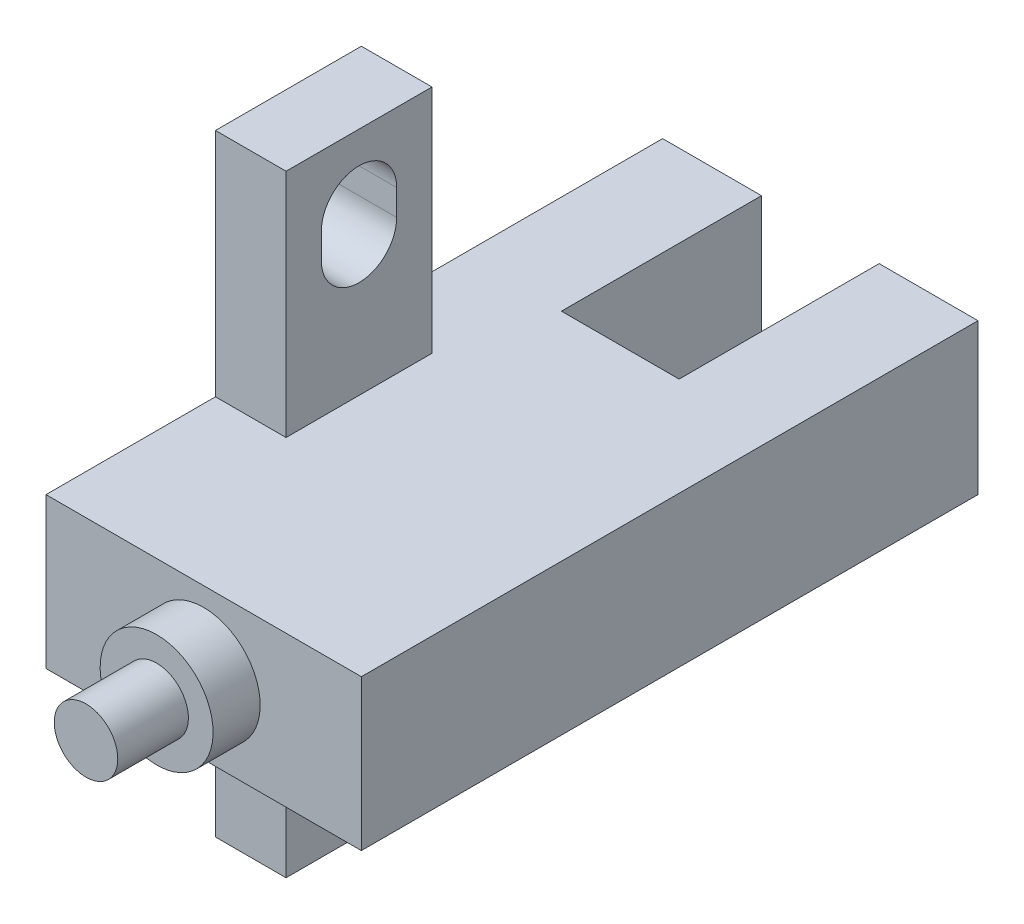
ISO-10303-21;
HEADER;
FILE_DESCRIPTION(('STEP AP214'),'2;1');
FILE_NAME('part.step','',(''),(''),'','','');
FILE_SCHEMA(('AUTOMOTIVE_DESIGN { 1 0 10303 214 1 1 1 1 }'));
ENDSEC;
DATA;
#1=APPLICATION_CONTEXT('core data for automotive mechanical design processes');
#2=APPLICATION_PROTOCOL_DEFINITION('international standard','automotive_design',2000,#1);
#3=PRODUCT_CONTEXT('',#1,'mechanical');
#4=PRODUCT('Part','Part','',(#3));
#5=PRODUCT_RELATED_PRODUCT_CATEGORY('part','',(#4));
#6=PRODUCT_DEFINITION_FORMATION('','',#4);
#7=PRODUCT_DEFINITION_CONTEXT('part definition',#1,'design');
#8=PRODUCT_DEFINITION('design','',#6,#7);
#9=PRODUCT_DEFINITION_SHAPE('','',#8);
#10=(LENGTH_UNIT() NAMED_UNIT(*) SI_UNIT(.MILLI.,.METRE.));
#11=(NAMED_UNIT(*) PLANE_ANGLE_UNIT() SI_UNIT($,.RADIAN.));
#12=(NAMED_UNIT(*) SI_UNIT($,.STERADIAN.) SOLID_ANGLE_UNIT());
#13=UNCERTAINTY_MEASURE_WITH_UNIT(LENGTH_MEASURE(1.E-05),#10,'distance_accuracy_value','');
#14=(GEOMETRIC_REPRESENTATION_CONTEXT(3) GLOBAL_UNCERTAINTY_ASSIGNED_CONTEXT((#13)) GLOBAL_UNIT_ASSIGNED_CONTEXT((#10,
#11,#12)) REPRESENTATION_CONTEXT('',''));
#15=CARTESIAN_POINT('',(0.,0.,0.));
#16=DIRECTION('',(0.,0.,1.));
#17=DIRECTION('',(1.,0.,0.));
#18=AXIS2_PLACEMENT_3D('',#15,#16,#17);
#19=CARTESIAN_POINT('',(-6.7,6.4,-26.2));
#20=DIRECTION('',(0.,0.,1.));
#21=DIRECTION('',(1.,0.,0.));
#22=AXIS2_PLACEMENT_3D('',#19,#20,#21);
#23=PLANE('',#22);
#24=DIRECTION('',(-1.,0.,0.));
#25=VECTOR('',#24,1.);
#26=CARTESIAN_POINT('',(-6.7,6.4,-26.2));
#27=LINE('',#26,#25);
#28=CARTESIAN_POINT('',(-2.5,6.4,-26.2));
#29=VERTEX_POINT('',#28);
#30=CARTESIAN_POINT('',(-6.7,6.4,-26.2));
#31=VERTEX_POINT('',#30);
#32=EDGE_CURVE('E341',#29,#31,#27,.T.);
#33=ORIENTED_EDGE('',*,*,#32,.F.);
#34=DIRECTION('',(0.,1.,0.));
#35=VECTOR('',#34,1.);
#36=CARTESIAN_POINT('',(-2.5,0.,-26.2));
#37=LINE('',#36,#35);
#38=CARTESIAN_POINT('',(-2.5,0.,-26.2));
#39=VERTEX_POINT('',#38);
#40=EDGE_CURVE('E325',#39,#29,#37,.T.);
#41=ORIENTED_EDGE('',*,*,#40,.F.);
#42=DIRECTION('',(-1.,0.,0.));
#43=VECTOR('',#42,1.);
#44=CARTESIAN_POINT('',(-6.7,0.,-26.2));
#45=LINE('',#44,#43);
#46=CARTESIAN_POINT('',(-6.7,0.,-26.2));
#47=VERTEX_POINT('',#46);
#48=EDGE_CURVE('E353',#39,#47,#45,.T.);
#49=ORIENTED_EDGE('',*,*,#48,.T.);
#50=DIRECTION('',(0.,-1.,0.));
#51=VECTOR('',#50,1.);
#52=CARTESIAN_POINT('',(-6.7,6.4,-26.2));
#53=LINE('',#52,#51);
#54=EDGE_CURVE('E345',#31,#47,#53,.T.);
#55=ORIENTED_EDGE('',*,*,#54,.F.);
#56=EDGE_LOOP('',(#33,#41,#49,#55));
#57=FACE_BOUND('',#56,.T.);
#58=ADVANCED_FACE('F32',(#57),#23,.F.);
#59=CARTESIAN_POINT('',(-6.7,6.4,0.));
#60=DIRECTION('',(1.,0.,0.));
#61=DIRECTION('',(0.,0.,-1.));
#62=AXIS2_PLACEMENT_3D('',#59,#60,#61);
#63=PLANE('',#62);
#64=DIRECTION('',(0.,-1.,0.));
#65=VECTOR('',#64,1.);
#66=CARTESIAN_POINT('',(-6.7,-6.85,-8.70000000000001));
#67=LINE('',#66,#65);
#68=CARTESIAN_POINT('',(-6.7,-5.75,-8.70000000000001));
#69=VERTEX_POINT('',#68);
#70=CARTESIAN_POINT('',(-6.7,-6.85,-8.70000000000001));
#71=VERTEX_POINT('',#70);
#72=EDGE_CURVE('E200',#69,#71,#67,.T.);
#73=ORIENTED_EDGE('',*,*,#72,.T.);
#74=CARTESIAN_POINT('',(-6.7,-6.85,-10.3));
#75=DIRECTION('',(1.,0.,0.));
#76=DIRECTION('',(0.,0.,1.));
#77=AXIS2_PLACEMENT_3D('',#74,#75,#76);
#78=CIRCLE('',#77,1.59999999999999);
#79=CARTESIAN_POINT('',(-6.7,-6.85,-11.9));
#80=VERTEX_POINT('',#79);
#81=EDGE_CURVE('E194',#71,#80,#78,.T.);
#82=ORIENTED_EDGE('',*,*,#81,.T.);
#83=DIRECTION('',(0.,1.,0.));
#84=VECTOR('',#83,1.);
#85=CARTESIAN_POINT('',(-6.7,-6.85,-11.9));
#86=LINE('',#85,#84);
#87=CARTESIAN_POINT('',(-6.7,-5.75,-11.9));
#88=VERTEX_POINT('',#87);
#89=EDGE_CURVE('E203',#80,#88,#86,.T.);
#90=ORIENTED_EDGE('',*,*,#89,.T.);
#91=CARTESIAN_POINT('',(-6.7,-5.75,-10.3));
#92=DIRECTION('',(1.,0.,0.));
#93=DIRECTION('',(0.,0.,1.));
#94=AXIS2_PLACEMENT_3D('',#91,#92,#93);
#95=CIRCLE('',#94,1.59999999999999);
#96=EDGE_CURVE('E47',#88,#69,#95,.T.);
#97=ORIENTED_EDGE('',*,*,#96,.T.);
#98=EDGE_LOOP('',(#73,#82,#90,#97));
#99=FACE_BOUND('',#98,.T.);
#100=DIRECTION('',(0.,1.,0.));
#101=VECTOR('',#100,1.);
#102=CARTESIAN_POINT('',(-6.7,13.25,-11.9));
#103=LINE('',#102,#101);
#104=CARTESIAN_POINT('',(-6.7,12.15,-11.9));
#105=VERTEX_POINT('',#104);
#106=CARTESIAN_POINT('',(-6.7,13.25,-11.9));
#107=VERTEX_POINT('',#106);
#108=EDGE_CURVE('E241',#105,#107,#103,.T.);
#109=ORIENTED_EDGE('',*,*,#108,.T.);
#110=CARTESIAN_POINT('',(-6.7,13.25,-10.3));
#111=DIRECTION('',(1.,0.,0.));
#112=DIRECTION('',(0.,0.,-1.));
#113=AXIS2_PLACEMENT_3D('',#110,#111,#112);
#114=CIRCLE('',#113,1.59999999999999);
#115=CARTESIAN_POINT('',(-6.7,13.25,-8.70000000000001));
#116=VERTEX_POINT('',#115);
#117=EDGE_CURVE('E231',#107,#116,#114,.T.);
#118=ORIENTED_EDGE('',*,*,#117,.T.);
#119=DIRECTION('',(0.,-1.,0.));
#120=VECTOR('',#119,1.);
#121=CARTESIAN_POINT('',(-6.7,13.25,-8.70000000000001));
#122=LINE('',#121,#120);
#123=CARTESIAN_POINT('',(-6.7,12.15,-8.70000000000001));
#124=VERTEX_POINT('',#123);
#125=EDGE_CURVE('E234',#116,#124,#122,.T.);
#126=ORIENTED_EDGE('',*,*,#125,.T.);
#127=CARTESIAN_POINT('',(-6.7,12.15,-10.3));
#128=DIRECTION('',(1.,0.,0.));
#129=DIRECTION('',(0.,0.,-1.));
#130=AXIS2_PLACEMENT_3D('',#127,#128,#129);
#131=CIRCLE('',#130,1.59999999999999);
#132=EDGE_CURVE('E238',#124,#105,#131,.T.);
#133=ORIENTED_EDGE('',*,*,#132,.T.);
#134=EDGE_LOOP('',(#109,#118,#126,#133));
#135=FACE_BOUND('',#134,.T.);
#136=DIRECTION('',(0.,0.,1.));
#137=VECTOR('',#136,1.);
#138=CARTESIAN_POINT('',(-6.7,6.4,0.));
#139=LINE('',#138,#137);
#140=CARTESIAN_POINT('',(-6.7,6.4,-7.2));
#141=VERTEX_POINT('',#140);
#142=CARTESIAN_POINT('',(-6.7,6.4,0.));
#143=VERTEX_POINT('',#142);
#144=EDGE_CURVE('E337',#141,#143,#139,.T.);
#145=ORIENTED_EDGE('',*,*,#144,.F.);
#146=DIRECTION('',(0.,1.,0.));
#147=VECTOR('',#146,1.);
#148=CARTESIAN_POINT('',(-6.7,16.2,-7.19999999999999));
#149=LINE('',#148,#147);
#150=CARTESIAN_POINT('',(-6.7,16.2,-7.19999999999999));
#151=VERTEX_POINT('',#150);
#152=EDGE_CURVE('E284',#141,#151,#149,.T.);
#153=ORIENTED_EDGE('',*,*,#152,.T.);
#154=DIRECTION('',(0.,0.,-1.));
#155=VECTOR('',#154,1.);
#156=CARTESIAN_POINT('',(-6.7,16.2,-13.4));
#157=LINE('',#156,#155);
#158=CARTESIAN_POINT('',(-6.7,16.2,-13.4));
#159=VERTEX_POINT('',#158);
#160=EDGE_CURVE('E287',#151,#159,#157,.T.);
#161=ORIENTED_EDGE('',*,*,#160,.T.);
#162=DIRECTION('',(0.,-1.,0.));
#163=VECTOR('',#162,1.);
#164=CARTESIAN_POINT('',(-6.7,16.2,-13.4));
#165=LINE('',#164,#163);
#166=CARTESIAN_POINT('',(-6.7,6.4,-13.4));
#167=VERTEX_POINT('',#166);
#168=EDGE_CURVE('E278',#159,#167,#165,.T.);
#169=ORIENTED_EDGE('',*,*,#168,.T.);
#170=EDGE_CURVE('E334',#31,#167,#139,.T.);
#171=ORIENTED_EDGE('',*,*,#170,.F.);
#172=ORIENTED_EDGE('',*,*,#54,.T.);
#173=DIRECTION('',(0.,0.,1.));
#174=VECTOR('',#173,1.);
#175=CARTESIAN_POINT('',(-6.7,0.,0.));
#176=LINE('',#175,#174);
#177=CARTESIAN_POINT('',(-6.7,0.,-13.4));
#178=VERTEX_POINT('',#177);
#179=EDGE_CURVE('E346',#47,#178,#176,.T.);
#180=ORIENTED_EDGE('',*,*,#179,.T.);
#181=CARTESIAN_POINT('',(-6.7,-9.8,-13.4));
#182=VERTEX_POINT('',#181);
#183=EDGE_CURVE('E256',#178,#182,#165,.T.);
#184=ORIENTED_EDGE('',*,*,#183,.T.);
#185=DIRECTION('',(0.,0.,1.));
#186=VECTOR('',#185,1.);
#187=CARTESIAN_POINT('',(-6.7,-9.8,-13.4));
#188=LINE('',#187,#186);
#189=CARTESIAN_POINT('',(-6.7,-9.8,-7.2));
#190=VERTEX_POINT('',#189);
#191=EDGE_CURVE('E281',#182,#190,#188,.T.);
#192=ORIENTED_EDGE('',*,*,#191,.T.);
#193=CARTESIAN_POINT('',(-6.7,0.,-7.19999999999999));
#194=VERTEX_POINT('',#193);
#195=EDGE_CURVE('E285',#190,#194,#149,.T.);
#196=ORIENTED_EDGE('',*,*,#195,.T.);
#197=CARTESIAN_POINT('',(-6.7,0.,0.));
#198=VERTEX_POINT('',#197);
#199=EDGE_CURVE('E327',#194,#198,#176,.T.);
#200=ORIENTED_EDGE('',*,*,#199,.T.);
#201=DIRECTION('',(0.,-1.,0.));
#202=VECTOR('',#201,1.);
#203=CARTESIAN_POINT('',(-6.7,6.4,0.));
#204=LINE('',#203,#202);
#205=EDGE_CURVE('E365',#143,#198,#204,.T.);
#206=ORIENTED_EDGE('',*,*,#205,.F.);
#207=EDGE_LOOP('',(#145,#153,#161,#169,#171,#172,#180,#184,#192,#196,#200,#206));
#208=FACE_BOUND('',#207,.T.);
#209=ADVANCED_FACE('F34',(#99,#135,#208),#63,.F.);
#210=CARTESIAN_POINT('',(-6.7,6.4,0.));
#211=DIRECTION('',(0.,0.,-1.));
#212=DIRECTION('',(-1.,0.,0.));
#213=AXIS2_PLACEMENT_3D('',#210,#211,#212);
#214=PLANE('',#213);
#215=CARTESIAN_POINT('',(0.,3.2,0.));
#216=DIRECTION('',(0.,0.,-1.));
#217=DIRECTION('',(0.,1.,0.));
#218=AXIS2_PLACEMENT_3D('',#215,#216,#217);
#219=CIRCLE('',#218,2.4);
#220=CARTESIAN_POINT('',(0.,5.6,0.));
#221=VERTEX_POINT('',#220);
#222=EDGE_CURVE('E215',#221,#221,#219,.T.);
#223=ORIENTED_EDGE('',*,*,#222,.T.);
#224=EDGE_LOOP('',(#223));
#225=FACE_BOUND('',#224,.T.);
#226=DIRECTION('',(1.,0.,0.));
#227=VECTOR('',#226,1.);
#228=CARTESIAN_POINT('',(-6.7,0.,0.));
#229=LINE('',#228,#227);
#230=CARTESIAN_POINT('',(6.7,0.,0.));
#231=VERTEX_POINT('',#230);
#232=EDGE_CURVE('E349',#198,#231,#229,.T.);
#233=ORIENTED_EDGE('',*,*,#232,.T.);
#234=DIRECTION('',(0.,-1.,0.));
#235=VECTOR('',#234,1.);
#236=CARTESIAN_POINT('',(6.7,6.4,0.));
#237=LINE('',#236,#235);
#238=CARTESIAN_POINT('',(6.7,6.4,0.));
#239=VERTEX_POINT('',#238);
#240=EDGE_CURVE('E362',#239,#231,#237,.T.);
#241=ORIENTED_EDGE('',*,*,#240,.F.);
#242=DIRECTION('',(1.,0.,0.));
#243=VECTOR('',#242,1.);
#244=CARTESIAN_POINT('',(-6.7,6.4,0.));
#245=LINE('',#244,#243);
#246=EDGE_CURVE('E336',#143,#239,#245,.T.);
#247=ORIENTED_EDGE('',*,*,#246,.F.);
#248=ORIENTED_EDGE('',*,*,#205,.T.);
#249=EDGE_LOOP('',(#233,#241,#247,#248));
#250=FACE_BOUND('',#249,.T.);
#251=ADVANCED_FACE('F422',(#225,#250),#214,.F.);
#252=CARTESIAN_POINT('',(6.7,6.4,0.));
#253=DIRECTION('',(-1.,0.,0.));
#254=DIRECTION('',(0.,0.,1.));
#255=AXIS2_PLACEMENT_3D('',#252,#253,#254);
#256=PLANE('',#255);
#257=DIRECTION('',(0.,0.,-1.));
#258=VECTOR('',#257,1.);
#259=CARTESIAN_POINT('',(6.7,0.,0.));
#260=LINE('',#259,#258);
#261=CARTESIAN_POINT('',(6.7,0.,-26.2));
#262=VERTEX_POINT('',#261);
#263=EDGE_CURVE('E351',#231,#262,#260,.T.);
#264=ORIENTED_EDGE('',*,*,#263,.T.);
#265=DIRECTION('',(0.,-1.,0.));
#266=VECTOR('',#265,1.);
#267=CARTESIAN_POINT('',(6.7,6.4,-26.2));
#268=LINE('',#267,#266);
#269=CARTESIAN_POINT('',(6.7,6.4,-26.2));
#270=VERTEX_POINT('',#269);
#271=EDGE_CURVE('E359',#270,#262,#268,.T.);
#272=ORIENTED_EDGE('',*,*,#271,.F.);
#273=DIRECTION('',(0.,0.,-1.));
#274=VECTOR('',#273,1.);
#275=CARTESIAN_POINT('',(6.7,6.4,0.));
#276=LINE('',#275,#274);
#277=EDGE_CURVE('E339',#239,#270,#276,.T.);
#278=ORIENTED_EDGE('',*,*,#277,.F.);
#279=ORIENTED_EDGE('',*,*,#240,.T.);
#280=EDGE_LOOP('',(#264,#272,#278,#279));
#281=FACE_BOUND('',#280,.T.);
#282=ADVANCED_FACE('F418',(#281),#256,.F.);
#283=CARTESIAN_POINT('',(2.5,0.,-26.2));
#284=VERTEX_POINT('',#283);
#285=EDGE_CURVE('E354',#262,#284,#45,.T.);
#286=ORIENTED_EDGE('',*,*,#285,.T.);
#287=DIRECTION('',(0.,1.,0.));
#288=VECTOR('',#287,1.);
#289=CARTESIAN_POINT('',(2.5,0.,-26.2));
#290=LINE('',#289,#288);
#291=CARTESIAN_POINT('',(2.5,6.4,-26.2));
#292=VERTEX_POINT('',#291);
#293=EDGE_CURVE('E328',#284,#292,#290,.T.);
#294=ORIENTED_EDGE('',*,*,#293,.T.);
#295=EDGE_CURVE('E342',#270,#292,#27,.T.);
#296=ORIENTED_EDGE('',*,*,#295,.F.);
#297=ORIENTED_EDGE('',*,*,#271,.T.);
#298=EDGE_LOOP('',(#286,#294,#296,#297));
#299=FACE_BOUND('',#298,.T.);
#300=ADVANCED_FACE('F413',(#299),#23,.F.);
#301=CARTESIAN_POINT('',(-6.7,6.4,-26.2));
#302=DIRECTION('',(0.,-1.,0.));
#303=DIRECTION('',(0.,0.,-1.));
#304=AXIS2_PLACEMENT_3D('',#301,#302,#303);
#305=PLANE('',#304);
#306=ORIENTED_EDGE('',*,*,#170,.T.);
#307=DIRECTION('',(1.,0.,0.));
#308=VECTOR('',#307,1.);
#309=CARTESIAN_POINT('',(-6.7,6.4,-13.4));
#310=LINE('',#309,#308);
#311=CARTESIAN_POINT('',(-3.7,6.4,-13.4));
#312=VERTEX_POINT('',#311);
#313=EDGE_CURVE('E305',#167,#312,#310,.T.);
#314=ORIENTED_EDGE('',*,*,#313,.T.);
#315=DIRECTION('',(0.,0.,-1.));
#316=VECTOR('',#315,1.);
#317=CARTESIAN_POINT('',(-3.7,6.4,-26.2));
#318=LINE('',#317,#316);
#319=CARTESIAN_POINT('',(-3.7,6.4,-7.19999999999999));
#320=VERTEX_POINT('',#319);
#321=EDGE_CURVE('E292',#320,#312,#318,.T.);
#322=ORIENTED_EDGE('',*,*,#321,.F.);
#323=DIRECTION('',(-1.,0.,0.));
#324=VECTOR('',#323,1.);
#325=CARTESIAN_POINT('',(-6.7,6.4,-7.19999999999999));
#326=LINE('',#325,#324);
#327=EDGE_CURVE('E302',#320,#141,#326,.T.);
#328=ORIENTED_EDGE('',*,*,#327,.T.);
#329=ORIENTED_EDGE('',*,*,#144,.T.);
#330=ORIENTED_EDGE('',*,*,#246,.T.);
#331=ORIENTED_EDGE('',*,*,#277,.T.);
#332=ORIENTED_EDGE('',*,*,#295,.T.);
#333=DIRECTION('',(0.,0.,-1.));
#334=VECTOR('',#333,1.);
#335=CARTESIAN_POINT('',(2.5,6.4,-26.2));
#336=LINE('',#335,#334);
#337=CARTESIAN_POINT('',(2.5,6.4,-17.7));
#338=VERTEX_POINT('',#337);
#339=EDGE_CURVE('E312',#338,#292,#336,.T.);
#340=ORIENTED_EDGE('',*,*,#339,.F.);
#341=DIRECTION('',(1.,0.,0.));
#342=VECTOR('',#341,1.);
#343=CARTESIAN_POINT('',(-2.5,6.4,-17.7));
#344=LINE('',#343,#342);
#345=CARTESIAN_POINT('',(-2.5,6.4,-17.7));
#346=VERTEX_POINT('',#345);
#347=EDGE_CURVE('E321',#346,#338,#344,.T.);
#348=ORIENTED_EDGE('',*,*,#347,.F.);
#349=DIRECTION('',(0.,0.,1.));
#350=VECTOR('',#349,1.);
#351=CARTESIAN_POINT('',(-2.5,6.4,-26.2));
#352=LINE('',#351,#350);
#353=EDGE_CURVE('E307',#29,#346,#352,.T.);
#354=ORIENTED_EDGE('',*,*,#353,.F.);
#355=ORIENTED_EDGE('',*,*,#32,.T.);
#356=EDGE_LOOP('',(#306,#314,#322,#328,#329,#330,#331,#332,#340,#348,#354,#355));
#357=FACE_BOUND('',#356,.T.);
#358=ADVANCED_FACE('F424',(#357),#305,.F.);
#359=CARTESIAN_POINT('',(-6.7,0.,-26.2));
#360=DIRECTION('',(0.,-1.,0.));
#361=DIRECTION('',(0.,0.,-1.));
#362=AXIS2_PLACEMENT_3D('',#359,#360,#361);
#363=PLANE('',#362);
#364=DIRECTION('',(1.,0.,0.));
#365=VECTOR('',#364,1.);
#366=CARTESIAN_POINT('',(-6.7,0.,-13.4));
#367=LINE('',#366,#365);
#368=CARTESIAN_POINT('',(-3.7,0.,-13.4));
#369=VERTEX_POINT('',#368);
#370=EDGE_CURVE('E11',#178,#369,#367,.T.);
#371=ORIENTED_EDGE('',*,*,#370,.F.);
#372=ORIENTED_EDGE('',*,*,#179,.F.);
#373=ORIENTED_EDGE('',*,*,#48,.F.);
#374=DIRECTION('',(0.,0.,1.));
#375=VECTOR('',#374,1.);
#376=CARTESIAN_POINT('',(-2.5,0.,-26.2));
#377=LINE('',#376,#375);
#378=CARTESIAN_POINT('',(-2.5,0.,-17.7));
#379=VERTEX_POINT('',#378);
#380=EDGE_CURVE('E308',#39,#379,#377,.T.);
#381=ORIENTED_EDGE('',*,*,#380,.T.);
#382=DIRECTION('',(1.,0.,0.));
#383=VECTOR('',#382,1.);
#384=CARTESIAN_POINT('',(-2.5,0.,-17.7));
#385=LINE('',#384,#383);
#386=CARTESIAN_POINT('',(2.5,0.,-17.7));
#387=VERTEX_POINT('',#386);
#388=EDGE_CURVE('E311',#379,#387,#385,.T.);
#389=ORIENTED_EDGE('',*,*,#388,.T.);
#390=DIRECTION('',(0.,0.,-1.));
#391=VECTOR('',#390,1.);
#392=CARTESIAN_POINT('',(2.5,0.,-26.2));
#393=LINE('',#392,#391);
#394=EDGE_CURVE('E315',#387,#284,#393,.T.);
#395=ORIENTED_EDGE('',*,*,#394,.T.);
#396=ORIENTED_EDGE('',*,*,#285,.F.);
#397=ORIENTED_EDGE('',*,*,#263,.F.);
#398=ORIENTED_EDGE('',*,*,#232,.F.);
#399=ORIENTED_EDGE('',*,*,#199,.F.);
#400=DIRECTION('',(-1.,0.,0.));
#401=VECTOR('',#400,1.);
#402=CARTESIAN_POINT('',(-6.7,0.,-7.2));
#403=LINE('',#402,#401);
#404=CARTESIAN_POINT('',(-3.7,0.,-7.2));
#405=VERTEX_POINT('',#404);
#406=EDGE_CURVE('E40',#405,#194,#403,.T.);
#407=ORIENTED_EDGE('',*,*,#406,.F.);
#408=DIRECTION('',(0.,0.,-1.));
#409=VECTOR('',#408,1.);
#410=CARTESIAN_POINT('',(-3.7,0.,-26.2));
#411=LINE('',#410,#409);
#412=EDGE_CURVE('E368',#405,#369,#411,.T.);
#413=ORIENTED_EDGE('',*,*,#412,.T.);
#414=EDGE_LOOP('',(#371,#372,#373,#381,#389,#395,#396,#397,#398,#399,#407,#413));
#415=FACE_BOUND('',#414,.T.);
#416=ADVANCED_FACE('F380',(#415),#363,.T.);
#417=CARTESIAN_POINT('',(-2.5,0.,-26.2));
#418=DIRECTION('',(-1.,0.,0.));
#419=DIRECTION('',(0.,0.,1.));
#420=AXIS2_PLACEMENT_3D('',#417,#418,#419);
#421=PLANE('',#420);
#422=ORIENTED_EDGE('',*,*,#353,.T.);
#423=DIRECTION('',(0.,1.,0.));
#424=VECTOR('',#423,1.);
#425=CARTESIAN_POINT('',(-2.5,0.,-17.7));
#426=LINE('',#425,#424);
#427=EDGE_CURVE('E318',#379,#346,#426,.T.);
#428=ORIENTED_EDGE('',*,*,#427,.F.);
#429=ORIENTED_EDGE('',*,*,#380,.F.);
#430=ORIENTED_EDGE('',*,*,#40,.T.);
#431=EDGE_LOOP('',(#422,#428,#429,#430));
#432=FACE_BOUND('',#431,.T.);
#433=ADVANCED_FACE('F402',(#432),#421,.F.);
#434=CARTESIAN_POINT('',(2.5,0.,-26.2));
#435=DIRECTION('',(1.,0.,0.));
#436=DIRECTION('',(0.,0.,-1.));
#437=AXIS2_PLACEMENT_3D('',#434,#435,#436);
#438=PLANE('',#437);
#439=ORIENTED_EDGE('',*,*,#339,.T.);
#440=ORIENTED_EDGE('',*,*,#293,.F.);
#441=ORIENTED_EDGE('',*,*,#394,.F.);
#442=DIRECTION('',(0.,1.,0.));
#443=VECTOR('',#442,1.);
#444=CARTESIAN_POINT('',(2.5,0.,-17.7));
#445=LINE('',#444,#443);
#446=EDGE_CURVE('E331',#387,#338,#445,.T.);
#447=ORIENTED_EDGE('',*,*,#446,.T.);
#448=EDGE_LOOP('',(#439,#440,#441,#447));
#449=FACE_BOUND('',#448,.T.);
#450=ADVANCED_FACE('F410',(#449),#438,.F.);
#451=CARTESIAN_POINT('',(-2.5,0.,-17.7));
#452=DIRECTION('',(0.,0.,1.));
#453=DIRECTION('',(1.,0.,0.));
#454=AXIS2_PLACEMENT_3D('',#451,#452,#453);
#455=PLANE('',#454);
#456=ORIENTED_EDGE('',*,*,#347,.T.);
#457=ORIENTED_EDGE('',*,*,#446,.F.);
#458=ORIENTED_EDGE('',*,*,#388,.F.);
#459=ORIENTED_EDGE('',*,*,#427,.T.);
#460=EDGE_LOOP('',(#456,#457,#458,#459));
#461=FACE_BOUND('',#460,.T.);
#462=ADVANCED_FACE('F407',(#461),#455,.F.);
#463=CARTESIAN_POINT('',(-3.7,-9.8,-13.4));
#464=DIRECTION('',(0.,-1.,0.));
#465=DIRECTION('',(0.,0.,-1.));
#466=AXIS2_PLACEMENT_3D('',#463,#464,#465);
#467=PLANE('',#466);
#468=ORIENTED_EDGE('',*,*,#191,.F.);
#469=DIRECTION('',(-1.,0.,0.));
#470=VECTOR('',#469,1.);
#471=CARTESIAN_POINT('',(-3.7,-9.8,-13.4));
#472=LINE('',#471,#470);
#473=CARTESIAN_POINT('',(-3.7,-9.8,-13.4));
#474=VERTEX_POINT('',#473);
#475=EDGE_CURVE('E277',#474,#182,#472,.T.);
#476=ORIENTED_EDGE('',*,*,#475,.F.);
#477=DIRECTION('',(0.,0.,1.));
#478=VECTOR('',#477,1.);
#479=CARTESIAN_POINT('',(-3.7,-9.8,-13.4));
#480=LINE('',#479,#478);
#481=CARTESIAN_POINT('',(-3.7,-9.8,-7.2));
#482=VERTEX_POINT('',#481);
#483=EDGE_CURVE('E266',#474,#482,#480,.T.);
#484=ORIENTED_EDGE('',*,*,#483,.T.);
#485=DIRECTION('',(-1.,0.,0.));
#486=VECTOR('',#485,1.);
#487=CARTESIAN_POINT('',(-3.7,-9.8,-7.2));
#488=LINE('',#487,#486);
#489=EDGE_CURVE('E296',#482,#190,#488,.T.);
#490=ORIENTED_EDGE('',*,*,#489,.T.);
#491=EDGE_LOOP('',(#468,#476,#484,#490));
#492=FACE_BOUND('',#491,.T.);
#493=ADVANCED_FACE('F387',(#492),#467,.T.);
#494=CARTESIAN_POINT('',(-3.7,-9.8,-13.4));
#495=DIRECTION('',(-1.,0.,0.));
#496=DIRECTION('',(0.,0.,1.));
#497=AXIS2_PLACEMENT_3D('',#494,#495,#496);
#498=PLANE('',#497);
#499=DIRECTION('',(0.,1.,0.));
#500=VECTOR('',#499,1.);
#501=CARTESIAN_POINT('',(-3.7,-6.85,-11.9));
#502=LINE('',#501,#500);
#503=CARTESIAN_POINT('',(-3.7,-6.85,-11.9));
#504=VERTEX_POINT('',#503);
#505=CARTESIAN_POINT('',(-3.7,-5.75,-11.9));
#506=VERTEX_POINT('',#505);
#507=EDGE_CURVE('E221',#504,#506,#502,.T.);
#508=ORIENTED_EDGE('',*,*,#507,.F.);
#509=CARTESIAN_POINT('',(-3.7,-6.85,-10.3));
#510=DIRECTION('',(1.,0.,0.));
#511=DIRECTION('',(0.,0.,1.));
#512=AXIS2_PLACEMENT_3D('',#509,#510,#511);
#513=CIRCLE('',#512,1.59999999999999);
#514=CARTESIAN_POINT('',(-3.7,-6.85,-8.70000000000001));
#515=VERTEX_POINT('',#514);
#516=EDGE_CURVE('E55',#515,#504,#513,.T.);
#517=ORIENTED_EDGE('',*,*,#516,.F.);
#518=DIRECTION('',(0.,-1.,0.));
#519=VECTOR('',#518,1.);
#520=CARTESIAN_POINT('',(-3.7,-6.85,-8.70000000000001));
#521=LINE('',#520,#519);
#522=CARTESIAN_POINT('',(-3.7,-5.75,-8.70000000000001));
#523=VERTEX_POINT('',#522);
#524=EDGE_CURVE('E209',#523,#515,#521,.T.);
#525=ORIENTED_EDGE('',*,*,#524,.F.);
#526=CARTESIAN_POINT('',(-3.7,-5.75,-10.3));
#527=DIRECTION('',(1.,0.,0.));
#528=DIRECTION('',(0.,0.,1.));
#529=AXIS2_PLACEMENT_3D('',#526,#527,#528);
#530=CIRCLE('',#529,1.59999999999999);
#531=EDGE_CURVE('E212',#506,#523,#530,.T.);
#532=ORIENTED_EDGE('',*,*,#531,.F.);
#533=EDGE_LOOP('',(#508,#517,#525,#532));
#534=FACE_BOUND('',#533,.T.);
#535=ORIENTED_EDGE('',*,*,#412,.F.);
#536=DIRECTION('',(0.,1.,0.));
#537=VECTOR('',#536,1.);
#538=CARTESIAN_POINT('',(-3.7,16.2,-7.19999999999999));
#539=LINE('',#538,#537);
#540=EDGE_CURVE('E271',#482,#405,#539,.T.);
#541=ORIENTED_EDGE('',*,*,#540,.F.);
#542=ORIENTED_EDGE('',*,*,#483,.F.);
#543=DIRECTION('',(0.,-1.,0.));
#544=VECTOR('',#543,1.);
#545=CARTESIAN_POINT('',(-3.7,16.2,-13.4));
#546=LINE('',#545,#544);
#547=EDGE_CURVE('E267',#369,#474,#546,.T.);
#548=ORIENTED_EDGE('',*,*,#547,.F.);
#549=EDGE_LOOP('',(#535,#541,#542,#548));
#550=FACE_BOUND('',#549,.T.);
#551=ADVANCED_FACE('F390',(#534,#550),#498,.F.);
#552=CARTESIAN_POINT('',(-3.7,16.2,-7.19999999999999));
#553=DIRECTION('',(0.,0.,1.));
#554=DIRECTION('',(0.,-1.,0.));
#555=AXIS2_PLACEMENT_3D('',#552,#553,#554);
#556=PLANE('',#555);
#557=ORIENTED_EDGE('',*,*,#540,.T.);
#558=ORIENTED_EDGE('',*,*,#406,.T.);
#559=ORIENTED_EDGE('',*,*,#195,.F.);
#560=ORIENTED_EDGE('',*,*,#489,.F.);
#561=EDGE_LOOP('',(#557,#558,#559,#560));
#562=FACE_BOUND('',#561,.T.);
#563=ADVANCED_FACE('F375',(#562),#556,.T.);
#564=CARTESIAN_POINT('',(-3.7,16.2,-13.4));
#565=DIRECTION('',(0.,0.,-1.));
#566=DIRECTION('',(0.,1.,0.));
#567=AXIS2_PLACEMENT_3D('',#564,#565,#566);
#568=PLANE('',#567);
#569=ORIENTED_EDGE('',*,*,#183,.F.);
#570=ORIENTED_EDGE('',*,*,#370,.T.);
#571=ORIENTED_EDGE('',*,*,#547,.T.);
#572=ORIENTED_EDGE('',*,*,#475,.T.);
#573=EDGE_LOOP('',(#569,#570,#571,#572));
#574=FACE_BOUND('',#573,.T.);
#575=ADVANCED_FACE('F632',(#574),#568,.T.);
#576=ORIENTED_EDGE('',*,*,#313,.F.);
#577=ORIENTED_EDGE('',*,*,#168,.F.);
#578=DIRECTION('',(-1.,0.,0.));
#579=VECTOR('',#578,1.);
#580=CARTESIAN_POINT('',(-3.7,16.2,-13.4));
#581=LINE('',#580,#579);
#582=CARTESIAN_POINT('',(-3.7,16.2,-13.4));
#583=VERTEX_POINT('',#582);
#584=EDGE_CURVE('E290',#583,#159,#581,.T.);
#585=ORIENTED_EDGE('',*,*,#584,.F.);
#586=EDGE_CURVE('E263',#583,#312,#546,.T.);
#587=ORIENTED_EDGE('',*,*,#586,.T.);
#588=EDGE_LOOP('',(#576,#577,#585,#587));
#589=FACE_BOUND('',#588,.T.);
#590=ADVANCED_FACE('F439',(#589),#568,.T.);
#591=ORIENTED_EDGE('',*,*,#327,.F.);
#592=CARTESIAN_POINT('',(-3.7,16.2,-7.19999999999999));
#593=VERTEX_POINT('',#592);
#594=EDGE_CURVE('E270',#320,#593,#539,.T.);
#595=ORIENTED_EDGE('',*,*,#594,.T.);
#596=DIRECTION('',(-1.,0.,0.));
#597=VECTOR('',#596,1.);
#598=CARTESIAN_POINT('',(-3.7,16.2,-7.19999999999999));
#599=LINE('',#598,#597);
#600=EDGE_CURVE('E293',#593,#151,#599,.T.);
#601=ORIENTED_EDGE('',*,*,#600,.T.);
#602=ORIENTED_EDGE('',*,*,#152,.F.);
#603=EDGE_LOOP('',(#591,#595,#601,#602));
#604=FACE_BOUND('',#603,.T.);
#605=ADVANCED_FACE('F430',(#604),#556,.T.);
#606=DIRECTION('',(0.,-1.,0.));
#607=VECTOR('',#606,1.);
#608=CARTESIAN_POINT('',(-3.7,13.25,-8.70000000000001));
#609=LINE('',#608,#607);
#610=CARTESIAN_POINT('',(-3.7,13.25,-8.70000000000001));
#611=VERTEX_POINT('',#610);
#612=CARTESIAN_POINT('',(-3.7,12.15,-8.70000000000001));
#613=VERTEX_POINT('',#612);
#614=EDGE_CURVE('E246',#611,#613,#609,.T.);
#615=ORIENTED_EDGE('',*,*,#614,.F.);
#616=CARTESIAN_POINT('',(-3.7,13.25,-10.3));
#617=DIRECTION('',(1.,0.,0.));
#618=DIRECTION('',(0.,0.,-1.));
#619=AXIS2_PLACEMENT_3D('',#616,#617,#618);
#620=CIRCLE('',#619,1.59999999999999);
#621=CARTESIAN_POINT('',(-3.7,13.25,-11.9));
#622=VERTEX_POINT('',#621);
#623=EDGE_CURVE('E227',#622,#611,#620,.T.);
#624=ORIENTED_EDGE('',*,*,#623,.F.);
#625=DIRECTION('',(0.,1.,0.));
#626=VECTOR('',#625,1.);
#627=CARTESIAN_POINT('',(-3.7,13.25,-11.9));
#628=LINE('',#627,#626);
#629=CARTESIAN_POINT('',(-3.7,12.15,-11.9));
#630=VERTEX_POINT('',#629);
#631=EDGE_CURVE('E235',#630,#622,#628,.T.);
#632=ORIENTED_EDGE('',*,*,#631,.F.);
#633=CARTESIAN_POINT('',(-3.7,12.15,-10.3));
#634=DIRECTION('',(1.,0.,0.));
#635=DIRECTION('',(0.,0.,-1.));
#636=AXIS2_PLACEMENT_3D('',#633,#634,#635);
#637=CIRCLE('',#636,1.59999999999999);
#638=EDGE_CURVE('E249',#613,#630,#637,.T.);
#639=ORIENTED_EDGE('',*,*,#638,.F.);
#640=EDGE_LOOP('',(#615,#624,#632,#639));
#641=FACE_BOUND('',#640,.T.);
#642=ORIENTED_EDGE('',*,*,#594,.F.);
#643=ORIENTED_EDGE('',*,*,#321,.T.);
#644=ORIENTED_EDGE('',*,*,#586,.F.);
#645=DIRECTION('',(0.,0.,-1.));
#646=VECTOR('',#645,1.);
#647=CARTESIAN_POINT('',(-3.7,16.2,-13.4));
#648=LINE('',#647,#646);
#649=EDGE_CURVE('E274',#593,#583,#648,.T.);
#650=ORIENTED_EDGE('',*,*,#649,.F.);
#651=EDGE_LOOP('',(#642,#643,#644,#650));
#652=FACE_BOUND('',#651,.T.);
#653=ADVANCED_FACE('F441',(#641,#652),#498,.F.);
#654=CARTESIAN_POINT('',(-3.7,16.2,-13.4));
#655=DIRECTION('',(0.,1.,0.));
#656=DIRECTION('',(0.,0.,1.));
#657=AXIS2_PLACEMENT_3D('',#654,#655,#656);
#658=PLANE('',#657);
#659=ORIENTED_EDGE('',*,*,#160,.F.);
#660=ORIENTED_EDGE('',*,*,#600,.F.);
#661=ORIENTED_EDGE('',*,*,#649,.T.);
#662=ORIENTED_EDGE('',*,*,#584,.T.);
#663=EDGE_LOOP('',(#659,#660,#661,#662));
#664=FACE_BOUND('',#663,.T.);
#665=ADVANCED_FACE('F434',(#664),#658,.T.);
#666=CARTESIAN_POINT('',(-6.7,13.25,-10.3));
#667=DIRECTION('',(1.,0.,0.));
#668=DIRECTION('',(0.,0.,-1.));
#669=AXIS2_PLACEMENT_3D('',#666,#667,#668);
#670=CYLINDRICAL_SURFACE('',#669,1.59999999999999);
#671=ORIENTED_EDGE('',*,*,#623,.T.);
#672=DIRECTION('',(1.,0.,0.));
#673=VECTOR('',#672,1.);
#674=CARTESIAN_POINT('',(-6.7,13.25,-8.70000000000001));
#675=LINE('',#674,#673);
#676=EDGE_CURVE('E244',#116,#611,#675,.T.);
#677=ORIENTED_EDGE('',*,*,#676,.F.);
#678=ORIENTED_EDGE('',*,*,#117,.F.);
#679=DIRECTION('',(1.,0.,0.));
#680=VECTOR('',#679,1.);
#681=CARTESIAN_POINT('',(-6.7,13.25,-11.9));
#682=LINE('',#681,#680);
#683=EDGE_CURVE('E254',#107,#622,#682,.T.);
#684=ORIENTED_EDGE('',*,*,#683,.T.);
#685=EDGE_LOOP('',(#671,#677,#678,#684));
#686=FACE_BOUND('',#685,.T.);
#687=ADVANCED_FACE('F449',(#686),#670,.F.);
#688=CARTESIAN_POINT('',(-6.7,13.25,-11.9));
#689=DIRECTION('',(0.,0.,-1.));
#690=DIRECTION('',(-1.,0.,0.));
#691=AXIS2_PLACEMENT_3D('',#688,#689,#690);
#692=PLANE('',#691);
#693=ORIENTED_EDGE('',*,*,#631,.T.);
#694=ORIENTED_EDGE('',*,*,#683,.F.);
#695=ORIENTED_EDGE('',*,*,#108,.F.);
#696=DIRECTION('',(1.,0.,0.));
#697=VECTOR('',#696,1.);
#698=CARTESIAN_POINT('',(-6.7,12.15,-11.9));
#699=LINE('',#698,#697);
#700=EDGE_CURVE('E257',#105,#630,#699,.T.);
#701=ORIENTED_EDGE('',*,*,#700,.T.);
#702=EDGE_LOOP('',(#693,#694,#695,#701));
#703=FACE_BOUND('',#702,.T.);
#704=ADVANCED_FACE('F520',(#703),#692,.F.);
#705=CARTESIAN_POINT('',(-6.7,12.15,-10.3));
#706=DIRECTION('',(1.,0.,0.));
#707=DIRECTION('',(0.,0.,-1.));
#708=AXIS2_PLACEMENT_3D('',#705,#706,#707);
#709=CYLINDRICAL_SURFACE('',#708,1.59999999999999);
#710=ORIENTED_EDGE('',*,*,#638,.T.);
#711=ORIENTED_EDGE('',*,*,#700,.F.);
#712=ORIENTED_EDGE('',*,*,#132,.F.);
#713=DIRECTION('',(1.,0.,0.));
#714=VECTOR('',#713,1.);
#715=CARTESIAN_POINT('',(-6.7,12.15,-8.70000000000001));
#716=LINE('',#715,#714);
#717=EDGE_CURVE('E259',#124,#613,#716,.T.);
#718=ORIENTED_EDGE('',*,*,#717,.T.);
#719=EDGE_LOOP('',(#710,#711,#712,#718));
#720=FACE_BOUND('',#719,.T.);
#721=ADVANCED_FACE('F523',(#720),#709,.F.);
#722=CARTESIAN_POINT('',(-6.7,13.25,-8.70000000000001));
#723=DIRECTION('',(0.,0.,1.));
#724=DIRECTION('',(1.,0.,0.));
#725=AXIS2_PLACEMENT_3D('',#722,#723,#724);
#726=PLANE('',#725);
#727=ORIENTED_EDGE('',*,*,#614,.T.);
#728=ORIENTED_EDGE('',*,*,#717,.F.);
#729=ORIENTED_EDGE('',*,*,#125,.F.);
#730=ORIENTED_EDGE('',*,*,#676,.T.);
#731=EDGE_LOOP('',(#727,#728,#729,#730));
#732=FACE_BOUND('',#731,.T.);
#733=ADVANCED_FACE('F519',(#732),#726,.F.);
#734=CARTESIAN_POINT('',(-6.7,-6.85,-10.3));
#735=DIRECTION('',(1.,0.,0.));
#736=DIRECTION('',(0.,0.,-1.));
#737=AXIS2_PLACEMENT_3D('',#734,#735,#736);
#738=CYLINDRICAL_SURFACE('',#737,1.59999999999999);
#739=ORIENTED_EDGE('',*,*,#516,.T.);
#740=DIRECTION('',(1.,0.,0.));
#741=VECTOR('',#740,1.);
#742=CARTESIAN_POINT('',(-6.7,-6.85,-11.9));
#743=LINE('',#742,#741);
#744=EDGE_CURVE('E190',#80,#504,#743,.T.);
#745=ORIENTED_EDGE('',*,*,#744,.F.);
#746=ORIENTED_EDGE('',*,*,#81,.F.);
#747=DIRECTION('',(1.,0.,0.));
#748=VECTOR('',#747,1.);
#749=CARTESIAN_POINT('',(-6.7,-6.85,-8.70000000000001));
#750=LINE('',#749,#748);
#751=EDGE_CURVE('E225',#71,#515,#750,.T.);
#752=ORIENTED_EDGE('',*,*,#751,.T.);
#753=EDGE_LOOP('',(#739,#745,#746,#752));
#754=FACE_BOUND('',#753,.T.);
#755=ADVANCED_FACE('F192',(#754),#738,.F.);
#756=CARTESIAN_POINT('',(-6.7,-6.85,-8.70000000000001));
#757=DIRECTION('',(0.,0.,1.));
#758=DIRECTION('',(1.,0.,0.));
#759=AXIS2_PLACEMENT_3D('',#756,#757,#758);
#760=PLANE('',#759);
#761=ORIENTED_EDGE('',*,*,#524,.T.);
#762=ORIENTED_EDGE('',*,*,#751,.F.);
#763=ORIENTED_EDGE('',*,*,#72,.F.);
#764=DIRECTION('',(1.,0.,0.));
#765=VECTOR('',#764,1.);
#766=CARTESIAN_POINT('',(-6.7,-5.75,-8.70000000000001));
#767=LINE('',#766,#765);
#768=EDGE_CURVE('E228',#69,#523,#767,.T.);
#769=ORIENTED_EDGE('',*,*,#768,.T.);
#770=EDGE_LOOP('',(#761,#762,#763,#769));
#771=FACE_BOUND('',#770,.T.);
#772=ADVANCED_FACE('F508',(#771),#760,.F.);
#773=CARTESIAN_POINT('',(-6.7,-5.75,-10.3));
#774=DIRECTION('',(1.,0.,0.));
#775=DIRECTION('',(0.,0.,-1.));
#776=AXIS2_PLACEMENT_3D('',#773,#774,#775);
#777=CYLINDRICAL_SURFACE('',#776,1.59999999999999);
#778=ORIENTED_EDGE('',*,*,#531,.T.);
#779=ORIENTED_EDGE('',*,*,#768,.F.);
#780=ORIENTED_EDGE('',*,*,#96,.F.);
#781=DIRECTION('',(1.,0.,0.));
#782=VECTOR('',#781,1.);
#783=CARTESIAN_POINT('',(-6.7,-5.75,-11.9));
#784=LINE('',#783,#782);
#785=EDGE_CURVE('E199',#88,#506,#784,.T.);
#786=ORIENTED_EDGE('',*,*,#785,.T.);
#787=EDGE_LOOP('',(#778,#779,#780,#786));
#788=FACE_BOUND('',#787,.T.);
#789=ADVANCED_FACE('F511',(#788),#777,.F.);
#790=CARTESIAN_POINT('',(-6.7,-6.85,-11.9));
#791=DIRECTION('',(0.,0.,-1.));
#792=DIRECTION('',(-1.,0.,0.));
#793=AXIS2_PLACEMENT_3D('',#790,#791,#792);
#794=PLANE('',#793);
#795=ORIENTED_EDGE('',*,*,#507,.T.);
#796=ORIENTED_EDGE('',*,*,#785,.F.);
#797=ORIENTED_EDGE('',*,*,#89,.F.);
#798=ORIENTED_EDGE('',*,*,#744,.T.);
#799=EDGE_LOOP('',(#795,#796,#797,#798));
#800=FACE_BOUND('',#799,.T.);
#801=ADVANCED_FACE('F204',(#800),#794,.F.);
#802=CARTESIAN_POINT('',(0.,3.2,-27.3544957691216));
#803=DIRECTION('',(0.,0.,-1.));
#804=DIRECTION('',(0.,1.,0.));
#805=AXIS2_PLACEMENT_3D('',#802,#803,#804);
#806=CYLINDRICAL_SURFACE('',#805,2.4);
#807=CARTESIAN_POINT('',(0.,3.2,2.));
#808=DIRECTION('',(0.,0.,-1.));
#809=DIRECTION('',(0.,1.,0.));
#810=AXIS2_PLACEMENT_3D('',#807,#808,#809);
#811=CIRCLE('',#810,2.4);
#812=CARTESIAN_POINT('',(0.,5.6,2.));
#813=VERTEX_POINT('',#812);
#814=EDGE_CURVE('E478',#813,#813,#811,.T.);
#815=ORIENTED_EDGE('',*,*,#814,.T.);
#816=EDGE_LOOP('',(#815));
#817=FACE_BOUND('',#816,.T.);
#818=ORIENTED_EDGE('',*,*,#222,.F.);
#819=EDGE_LOOP('',(#818));
#820=FACE_BOUND('',#819,.T.);
#821=ADVANCED_FACE('F504',(#817,#820),#806,.T.);
#822=CARTESIAN_POINT('',(0.,5.6,2.));
#823=DIRECTION('',(0.,0.,1.));
#824=DIRECTION('',(0.,-1.,0.));
#825=AXIS2_PLACEMENT_3D('',#822,#823,#824);
#826=PLANE('',#825);
#827=CARTESIAN_POINT('',(0.,3.2,2.));
#828=DIRECTION('',(0.,0.,-1.));
#829=DIRECTION('',(0.,1.,0.));
#830=AXIS2_PLACEMENT_3D('',#827,#828,#829);
#831=CIRCLE('',#830,1.35);
#832=CARTESIAN_POINT('',(0.,4.55,2.));
#833=VERTEX_POINT('',#832);
#834=EDGE_CURVE('E480',#833,#833,#831,.T.);
#835=ORIENTED_EDGE('',*,*,#834,.T.);
#836=EDGE_LOOP('',(#835));
#837=FACE_BOUND('',#836,.T.);
#838=ORIENTED_EDGE('',*,*,#814,.F.);
#839=EDGE_LOOP('',(#838));
#840=FACE_BOUND('',#839,.T.);
#841=ADVANCED_FACE('F499',(#837,#840),#826,.T.);
#842=CARTESIAN_POINT('',(0.,3.2,-27.3544957691216));
#843=DIRECTION('',(0.,0.,-1.));
#844=DIRECTION('',(0.,1.,0.));
#845=AXIS2_PLACEMENT_3D('',#842,#843,#844);
#846=CYLINDRICAL_SURFACE('',#845,1.35);
#847=CARTESIAN_POINT('',(0.,3.2,5.));
#848=DIRECTION('',(0.,0.,-1.));
#849=DIRECTION('',(0.,1.,0.));
#850=AXIS2_PLACEMENT_3D('',#847,#848,#849);
#851=CIRCLE('',#850,1.35);
#852=CARTESIAN_POINT('',(0.,4.55,5.));
#853=VERTEX_POINT('',#852);
#854=EDGE_CURVE('E484',#853,#853,#851,.T.);
#855=ORIENTED_EDGE('',*,*,#854,.T.);
#856=EDGE_LOOP('',(#855));
#857=FACE_BOUND('',#856,.T.);
#858=ORIENTED_EDGE('',*,*,#834,.F.);
#859=EDGE_LOOP('',(#858));
#860=FACE_BOUND('',#859,.T.);
#861=ADVANCED_FACE('F490',(#857,#860),#846,.T.);
#862=CARTESIAN_POINT('',(0.,4.55,5.));
#863=DIRECTION('',(0.,0.,1.));
#864=DIRECTION('',(0.,-1.,0.));
#865=AXIS2_PLACEMENT_3D('',#862,#863,#864);
#866=PLANE('',#865);
#867=ORIENTED_EDGE('',*,*,#854,.F.);
#868=EDGE_LOOP('',(#867));
#869=FACE_BOUND('',#868,.T.);
#870=ADVANCED_FACE('F493',(#869),#866,.T.);
#871=CLOSED_SHELL('',(#58,#209,#251,#282,#300,#358,#416,#433,#450,#462,#493,#551,#563,#575,#590,
#605,#653,#665,#687,#704,#721,#733,#755,#772,#789,#801,#821,#841,#861,#870));
#872=MANIFOLD_SOLID_BREP('B2',#871);
#873=ADVANCED_BREP_SHAPE_REPRESENTATION('',(#18,#872),#14);
#874=SHAPE_DEFINITION_REPRESENTATION(#9,#873);
ENDSEC;
END-ISO-10303-21;
